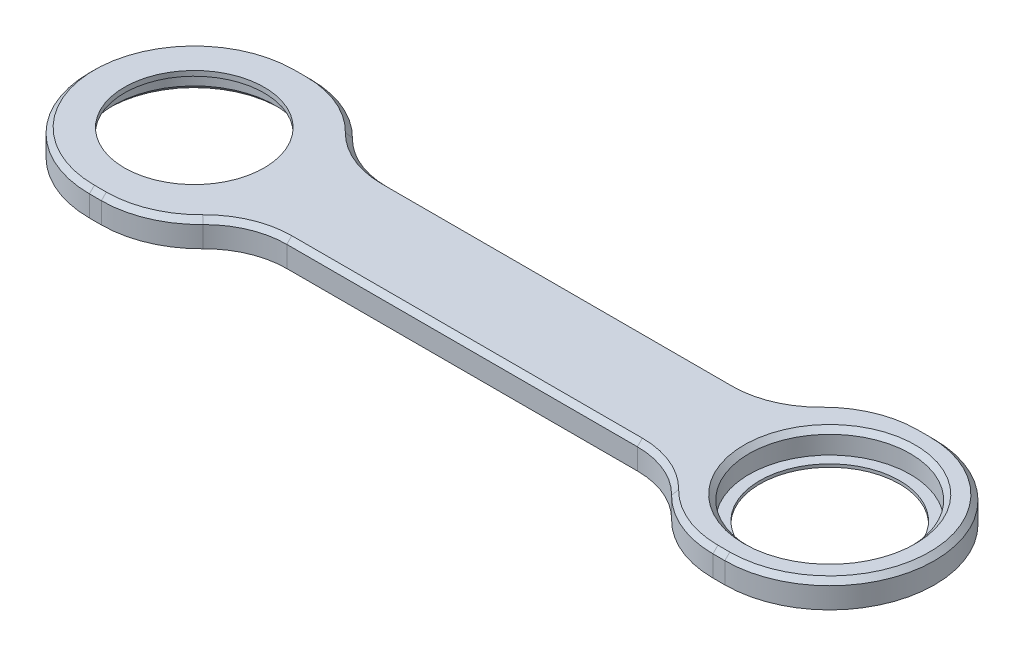
ISO-10303-21;
HEADER;
FILE_DESCRIPTION(('STEP AP214'),'2;1');
FILE_NAME('part.step','',(''),(''),'','','');
FILE_SCHEMA(('AUTOMOTIVE_DESIGN { 1 0 10303 214 1 1 1 1 }'));
ENDSEC;
DATA;
#1=APPLICATION_CONTEXT('core data for automotive mechanical design processes');
#2=APPLICATION_PROTOCOL_DEFINITION('international standard','automotive_design',2000,#1);
#3=PRODUCT_CONTEXT('',#1,'mechanical');
#4=PRODUCT('Part','Part','',(#3));
#5=PRODUCT_RELATED_PRODUCT_CATEGORY('part','',(#4));
#6=PRODUCT_DEFINITION_FORMATION('','',#4);
#7=PRODUCT_DEFINITION_CONTEXT('part definition',#1,'design');
#8=PRODUCT_DEFINITION('design','',#6,#7);
#9=PRODUCT_DEFINITION_SHAPE('','',#8);
#10=(LENGTH_UNIT() NAMED_UNIT(*) SI_UNIT(.MILLI.,.METRE.));
#11=(NAMED_UNIT(*) PLANE_ANGLE_UNIT() SI_UNIT($,.RADIAN.));
#12=(NAMED_UNIT(*) SI_UNIT($,.STERADIAN.) SOLID_ANGLE_UNIT());
#13=UNCERTAINTY_MEASURE_WITH_UNIT(LENGTH_MEASURE(1.E-05),#10,'distance_accuracy_value','');
#14=(GEOMETRIC_REPRESENTATION_CONTEXT(3) GLOBAL_UNCERTAINTY_ASSIGNED_CONTEXT((#13)) GLOBAL_UNIT_ASSIGNED_CONTEXT((#10,
#11,#12)) REPRESENTATION_CONTEXT('',''));
#15=CARTESIAN_POINT('',(0.,0.,0.));
#16=DIRECTION('',(0.,0.,1.));
#17=DIRECTION('',(1.,0.,0.));
#18=AXIS2_PLACEMENT_3D('',#15,#16,#17);
#19=CARTESIAN_POINT('',(-63.625,5.2,0.));
#20=DIRECTION('',(0.,-1.,0.));
#21=DIRECTION('',(0.,0.,-1.));
#22=AXIS2_PLACEMENT_3D('',#19,#20,#21);
#23=CYLINDRICAL_SURFACE('',#22,16.15);
#24=CARTESIAN_POINT('',(-63.625,0.99999999999997,0.));
#25=DIRECTION('',(0.,1.,0.));
#26=DIRECTION('',(0.,0.,1.));
#27=AXIS2_PLACEMENT_3D('',#24,#25,#26);
#28=CIRCLE('',#27,16.15);
#29=CARTESIAN_POINT('',(-63.625,0.99999999999997,16.15));
#30=VERTEX_POINT('',#29);
#31=EDGE_CURVE('E11',#30,#30,#28,.F.);
#32=ORIENTED_EDGE('',*,*,#31,.T.);
#33=EDGE_LOOP('',(#32));
#34=FACE_BOUND('',#33,.T.);
#35=CARTESIAN_POINT('',(-63.625,4.2,0.));
#36=DIRECTION('',(0.,1.,0.));
#37=DIRECTION('',(0.,0.,1.));
#38=AXIS2_PLACEMENT_3D('',#35,#36,#37);
#39=CIRCLE('',#38,16.15);
#40=CARTESIAN_POINT('',(-63.625,4.2,16.15));
#41=VERTEX_POINT('',#40);
#42=EDGE_CURVE('E495',#41,#41,#39,.T.);
#43=ORIENTED_EDGE('',*,*,#42,.T.);
#44=EDGE_LOOP('',(#43));
#45=FACE_BOUND('',#44,.T.);
#46=ADVANCED_FACE('F43',(#34,#45),#23,.F.);
#47=CARTESIAN_POINT('',(63.625,5.2,0.));
#48=DIRECTION('',(0.,-1.,0.));
#49=DIRECTION('',(0.,0.,-1.));
#50=AXIS2_PLACEMENT_3D('',#47,#48,#49);
#51=CYLINDRICAL_SURFACE('',#50,16.15);
#52=CARTESIAN_POINT('',(63.625,4.20000000000002,0.));
#53=DIRECTION('',(0.,1.,0.));
#54=DIRECTION('',(0.,0.,1.));
#55=AXIS2_PLACEMENT_3D('',#52,#53,#54);
#56=CIRCLE('',#55,16.15);
#57=CARTESIAN_POINT('',(63.625,4.20000000000002,16.15));
#58=VERTEX_POINT('',#57);
#59=EDGE_CURVE('E388',#58,#58,#56,.T.);
#60=ORIENTED_EDGE('',*,*,#59,.T.);
#61=EDGE_LOOP('',(#60));
#62=FACE_BOUND('',#61,.T.);
#63=CARTESIAN_POINT('',(63.625,0.6,0.));
#64=DIRECTION('',(0.,-1.,0.));
#65=DIRECTION('',(0.,0.,-1.));
#66=AXIS2_PLACEMENT_3D('',#63,#64,#65);
#67=CIRCLE('',#66,16.15);
#68=CARTESIAN_POINT('',(63.625,0.6,-16.15));
#69=VERTEX_POINT('',#68);
#70=EDGE_CURVE('E433',#69,#69,#67,.T.);
#71=ORIENTED_EDGE('',*,*,#70,.T.);
#72=EDGE_LOOP('',(#71));
#73=FACE_BOUND('',#72,.T.);
#74=ADVANCED_FACE('F516',(#62,#73),#51,.F.);
#75=CARTESIAN_POINT('',(35.1066134191231,5.2,26.5457507457693));
#76=DIRECTION('',(0.,-1.,0.));
#77=DIRECTION('',(0.,0.,-1.));
#78=AXIS2_PLACEMENT_3D('',#75,#76,#77);
#79=CYLINDRICAL_SURFACE('',#78,16.5457507457693);
#80=DIRECTION('',(0.,-1.,0.));
#81=VECTOR('',#80,1.);
#82=CARTESIAN_POINT('',(46.9387183735375,5.2,14.9801482932877));
#83=LINE('',#82,#81);
#84=CARTESIAN_POINT('',(46.9387183735375,0.,14.9801482932877));
#85=VERTEX_POINT('',#84);
#86=CARTESIAN_POINT('',(46.9387183735375,4.2,14.9801482932877));
#87=VERTEX_POINT('',#86);
#88=EDGE_CURVE('E302',#85,#87,#83,.F.);
#89=ORIENTED_EDGE('',*,*,#88,.T.);
#90=CARTESIAN_POINT('',(35.1066134191231,4.2,26.5457507457693));
#91=DIRECTION('',(0.,1.,0.));
#92=DIRECTION('',(0.,0.,1.));
#93=AXIS2_PLACEMENT_3D('',#90,#91,#92);
#94=CIRCLE('',#93,16.5457507457693);
#95=CARTESIAN_POINT('',(35.106613419123,4.2,9.99999999999998));
#96=VERTEX_POINT('',#95);
#97=EDGE_CURVE('E60',#87,#96,#94,.T.);
#98=ORIENTED_EDGE('',*,*,#97,.T.);
#99=DIRECTION('',(0.,-1.,0.));
#100=VECTOR('',#99,1.);
#101=CARTESIAN_POINT('',(35.106613419123,5.2,9.99999999999998));
#102=LINE('',#101,#100);
#103=CARTESIAN_POINT('',(35.106613419123,0.,9.99999999999998));
#104=VERTEX_POINT('',#103);
#105=EDGE_CURVE('E268',#96,#104,#102,.T.);
#106=ORIENTED_EDGE('',*,*,#105,.T.);
#107=CARTESIAN_POINT('',(35.1066134191231,0.,26.5457507457693));
#108=DIRECTION('',(0.,1.,0.));
#109=DIRECTION('',(0.,0.,1.));
#110=AXIS2_PLACEMENT_3D('',#107,#108,#109);
#111=CIRCLE('',#110,16.5457507457693);
#112=EDGE_CURVE('E235',#85,#104,#111,.T.);
#113=ORIENTED_EDGE('',*,*,#112,.F.);
#114=EDGE_LOOP('',(#89,#98,#106,#113));
#115=FACE_BOUND('',#114,.T.);
#116=ADVANCED_FACE('F522',(#115),#79,.F.);
#117=CARTESIAN_POINT('',(0.,5.2,21.));
#118=DIRECTION('',(0.,0.,1.));
#119=DIRECTION('',(1.,0.,0.));
#120=AXIS2_PLACEMENT_3D('',#117,#118,#119);
#121=PLANE('',#120);
#122=DIRECTION('',(0.,-1.,0.));
#123=VECTOR('',#122,1.);
#124=CARTESIAN_POINT('',(63.625,5.2,21.));
#125=LINE('',#124,#123);
#126=CARTESIAN_POINT('',(63.625,4.2,21.));
#127=VERTEX_POINT('',#126);
#128=CARTESIAN_POINT('',(63.625,0.,21.));
#129=VERTEX_POINT('',#128);
#130=EDGE_CURVE('E207',#127,#129,#125,.T.);
#131=ORIENTED_EDGE('',*,*,#130,.F.);
#132=DIRECTION('',(-1.,0.,0.));
#133=VECTOR('',#132,1.);
#134=CARTESIAN_POINT('',(0.,4.2,21.));
#135=LINE('',#134,#133);
#136=CARTESIAN_POINT('',(61.2410067812604,4.2,21.));
#137=VERTEX_POINT('',#136);
#138=EDGE_CURVE('E413',#127,#137,#135,.T.);
#139=ORIENTED_EDGE('',*,*,#138,.T.);
#140=DIRECTION('',(0.,-1.,0.));
#141=VECTOR('',#140,1.);
#142=CARTESIAN_POINT('',(61.2410067812604,5.2,21.));
#143=LINE('',#142,#141);
#144=CARTESIAN_POINT('',(61.2410067812604,0.,21.));
#145=VERTEX_POINT('',#144);
#146=EDGE_CURVE('E218',#137,#145,#143,.T.);
#147=ORIENTED_EDGE('',*,*,#146,.T.);
#148=DIRECTION('',(-1.,0.,0.));
#149=VECTOR('',#148,1.);
#150=CARTESIAN_POINT('',(0.,0.,21.));
#151=LINE('',#150,#149);
#152=EDGE_CURVE('E226',#129,#145,#151,.T.);
#153=ORIENTED_EDGE('',*,*,#152,.F.);
#154=EDGE_LOOP('',(#131,#139,#147,#153));
#155=FACE_BOUND('',#154,.T.);
#156=ADVANCED_FACE('F231',(#155),#121,.T.);
#157=CARTESIAN_POINT('',(63.625,5.2,0.));
#158=DIRECTION('',(0.,-1.,0.));
#159=DIRECTION('',(0.,0.,-1.));
#160=AXIS2_PLACEMENT_3D('',#157,#158,#159);
#161=CYLINDRICAL_SURFACE('',#160,21.);
#162=DIRECTION('',(0.,-1.,0.));
#163=VECTOR('',#162,1.);
#164=CARTESIAN_POINT('',(63.625,5.2,-21.));
#165=LINE('',#164,#163);
#166=CARTESIAN_POINT('',(63.625,4.2,-21.));
#167=VERTEX_POINT('',#166);
#168=CARTESIAN_POINT('',(63.625,0.,-21.));
#169=VERTEX_POINT('',#168);
#170=EDGE_CURVE('E219',#167,#169,#165,.T.);
#171=ORIENTED_EDGE('',*,*,#170,.F.);
#172=CARTESIAN_POINT('',(63.625,4.19999999999999,0.));
#173=DIRECTION('',(0.,1.,0.));
#174=DIRECTION('',(0.,0.,1.));
#175=AXIS2_PLACEMENT_3D('',#172,#173,#174);
#176=CIRCLE('',#175,21.);
#177=EDGE_CURVE('E213',#167,#127,#176,.F.);
#178=ORIENTED_EDGE('',*,*,#177,.T.);
#179=ORIENTED_EDGE('',*,*,#130,.T.);
#180=CARTESIAN_POINT('',(63.625,0.,0.));
#181=DIRECTION('',(0.,1.,0.));
#182=DIRECTION('',(0.,0.,1.));
#183=AXIS2_PLACEMENT_3D('',#180,#181,#182);
#184=CIRCLE('',#183,21.);
#185=EDGE_CURVE('E211',#129,#169,#184,.T.);
#186=ORIENTED_EDGE('',*,*,#185,.T.);
#187=EDGE_LOOP('',(#171,#178,#179,#186));
#188=FACE_BOUND('',#187,.T.);
#189=ADVANCED_FACE('F210',(#188),#161,.T.);
#190=CARTESIAN_POINT('',(0.,5.2,-21.));
#191=DIRECTION('',(0.,0.,1.));
#192=DIRECTION('',(1.,0.,0.));
#193=AXIS2_PLACEMENT_3D('',#190,#191,#192);
#194=PLANE('',#193);
#195=DIRECTION('',(0.,1.,0.));
#196=VECTOR('',#195,1.);
#197=CARTESIAN_POINT('',(61.2410067812603,5.2,-21.));
#198=LINE('',#197,#196);
#199=CARTESIAN_POINT('',(61.2410067812603,0.,-21.));
#200=VERTEX_POINT('',#199);
#201=CARTESIAN_POINT('',(61.2410067812603,4.2,-21.));
#202=VERTEX_POINT('',#201);
#203=EDGE_CURVE('E308',#200,#202,#198,.T.);
#204=ORIENTED_EDGE('',*,*,#203,.T.);
#205=DIRECTION('',(1.,0.,0.));
#206=VECTOR('',#205,1.);
#207=CARTESIAN_POINT('',(63.625,4.2,-21.));
#208=LINE('',#207,#206);
#209=EDGE_CURVE('E407',#202,#167,#208,.T.);
#210=ORIENTED_EDGE('',*,*,#209,.T.);
#211=ORIENTED_EDGE('',*,*,#170,.T.);
#212=DIRECTION('',(-1.,0.,0.));
#213=VECTOR('',#212,1.);
#214=CARTESIAN_POINT('',(0.,0.,-21.));
#215=LINE('',#214,#213);
#216=EDGE_CURVE('E228',#169,#200,#215,.T.);
#217=ORIENTED_EDGE('',*,*,#216,.T.);
#218=EDGE_LOOP('',(#204,#210,#211,#217));
#219=FACE_BOUND('',#218,.T.);
#220=ADVANCED_FACE('F549',(#219),#194,.F.);
#221=CARTESIAN_POINT('',(35.1066134191231,5.2,-26.5457507457693));
#222=DIRECTION('',(0.,-1.,0.));
#223=DIRECTION('',(0.,0.,-1.));
#224=AXIS2_PLACEMENT_3D('',#221,#222,#223);
#225=CYLINDRICAL_SURFACE('',#224,16.5457507457693);
#226=DIRECTION('',(0.,-1.,0.));
#227=VECTOR('',#226,1.);
#228=CARTESIAN_POINT('',(35.106613419123,5.2,-9.99999999999999));
#229=LINE('',#228,#227);
#230=CARTESIAN_POINT('',(35.106613419123,4.2,-9.99999999999999));
#231=VERTEX_POINT('',#230);
#232=CARTESIAN_POINT('',(35.106613419123,0.,-9.99999999999999));
#233=VERTEX_POINT('',#232);
#234=EDGE_CURVE('E283',#231,#233,#229,.T.);
#235=ORIENTED_EDGE('',*,*,#234,.F.);
#236=CARTESIAN_POINT('',(35.1066134191231,4.2,-26.5457507457693));
#237=DIRECTION('',(0.,1.,0.));
#238=DIRECTION('',(0.,0.,1.));
#239=AXIS2_PLACEMENT_3D('',#236,#237,#238);
#240=CIRCLE('',#239,16.5457507457693);
#241=CARTESIAN_POINT('',(46.9387183735375,4.2,-14.9801482932877));
#242=VERTEX_POINT('',#241);
#243=EDGE_CURVE('E395',#231,#242,#240,.T.);
#244=ORIENTED_EDGE('',*,*,#243,.T.);
#245=DIRECTION('',(0.,-1.,0.));
#246=VECTOR('',#245,1.);
#247=CARTESIAN_POINT('',(46.9387183735375,5.2,-14.9801482932877));
#248=LINE('',#247,#246);
#249=CARTESIAN_POINT('',(46.9387183735375,0.,-14.9801482932877));
#250=VERTEX_POINT('',#249);
#251=EDGE_CURVE('E305',#242,#250,#248,.T.);
#252=ORIENTED_EDGE('',*,*,#251,.T.);
#253=CARTESIAN_POINT('',(35.1066134191231,0.,-26.5457507457693));
#254=DIRECTION('',(0.,1.,0.));
#255=DIRECTION('',(0.,0.,1.));
#256=AXIS2_PLACEMENT_3D('',#253,#254,#255);
#257=CIRCLE('',#256,16.5457507457693);
#258=EDGE_CURVE('E1063',#233,#250,#257,.T.);
#259=ORIENTED_EDGE('',*,*,#258,.F.);
#260=EDGE_LOOP('',(#235,#244,#252,#259));
#261=FACE_BOUND('',#260,.T.);
#262=ADVANCED_FACE('F556',(#261),#225,.F.);
#263=CARTESIAN_POINT('',(0.,5.2,-9.99999999999999));
#264=DIRECTION('',(0.,0.,-1.));
#265=DIRECTION('',(-1.,0.,0.));
#266=AXIS2_PLACEMENT_3D('',#263,#264,#265);
#267=PLANE('',#266);
#268=DIRECTION('',(0.,-1.,0.));
#269=VECTOR('',#268,1.);
#270=CARTESIAN_POINT('',(-35.106613419123,5.2,-9.99999999999999));
#271=LINE('',#270,#269);
#272=CARTESIAN_POINT('',(-35.106613419123,4.2,-9.99999999999999));
#273=VERTEX_POINT('',#272);
#274=CARTESIAN_POINT('',(-35.106613419123,0.,-9.99999999999999));
#275=VERTEX_POINT('',#274);
#276=EDGE_CURVE('E280',#273,#275,#271,.T.);
#277=ORIENTED_EDGE('',*,*,#276,.F.);
#278=DIRECTION('',(1.,0.,0.));
#279=VECTOR('',#278,1.);
#280=CARTESIAN_POINT('',(0.,4.20000000000003,-9.99999999999999));
#281=LINE('',#280,#279);
#282=EDGE_CURVE('E385',#273,#231,#281,.T.);
#283=ORIENTED_EDGE('',*,*,#282,.T.);
#284=ORIENTED_EDGE('',*,*,#234,.T.);
#285=DIRECTION('',(1.,0.,0.));
#286=VECTOR('',#285,1.);
#287=CARTESIAN_POINT('',(0.,0.,-9.99999999999999));
#288=LINE('',#287,#286);
#289=EDGE_CURVE('E1066',#275,#233,#288,.T.);
#290=ORIENTED_EDGE('',*,*,#289,.F.);
#291=EDGE_LOOP('',(#277,#283,#284,#290));
#292=FACE_BOUND('',#291,.T.);
#293=ADVANCED_FACE('F552',(#292),#267,.T.);
#294=CARTESIAN_POINT('',(-35.1066134191231,5.2,-26.5457507457693));
#295=DIRECTION('',(0.,-1.,0.));
#296=DIRECTION('',(0.,0.,-1.));
#297=AXIS2_PLACEMENT_3D('',#294,#295,#296);
#298=CYLINDRICAL_SURFACE('',#297,16.5457507457693);
#299=DIRECTION('',(0.,-1.,0.));
#300=VECTOR('',#299,1.);
#301=CARTESIAN_POINT('',(-46.9387183735375,5.2,-14.9801482932877));
#302=LINE('',#301,#300);
#303=CARTESIAN_POINT('',(-46.9387183735375,0.,-14.9801482932877));
#304=VERTEX_POINT('',#303);
#305=CARTESIAN_POINT('',(-46.9387183735375,4.2,-14.9801482932877));
#306=VERTEX_POINT('',#305);
#307=EDGE_CURVE('E315',#304,#306,#302,.F.);
#308=ORIENTED_EDGE('',*,*,#307,.T.);
#309=CARTESIAN_POINT('',(-35.1066134191231,4.2,-26.5457507457693));
#310=DIRECTION('',(0.,1.,0.));
#311=DIRECTION('',(0.,0.,1.));
#312=AXIS2_PLACEMENT_3D('',#309,#310,#311);
#313=CIRCLE('',#312,16.5457507457693);
#314=EDGE_CURVE('E392',#306,#273,#313,.T.);
#315=ORIENTED_EDGE('',*,*,#314,.T.);
#316=ORIENTED_EDGE('',*,*,#276,.T.);
#317=CARTESIAN_POINT('',(-35.1066134191231,0.,-26.5457507457693));
#318=DIRECTION('',(0.,1.,0.));
#319=DIRECTION('',(0.,0.,1.));
#320=AXIS2_PLACEMENT_3D('',#317,#318,#319);
#321=CIRCLE('',#320,16.5457507457693);
#322=EDGE_CURVE('E260',#304,#275,#321,.T.);
#323=ORIENTED_EDGE('',*,*,#322,.F.);
#324=EDGE_LOOP('',(#308,#315,#316,#323));
#325=FACE_BOUND('',#324,.T.);
#326=ADVANCED_FACE('F547',(#325),#298,.F.);
#327=DIRECTION('',(0.,-1.,0.));
#328=VECTOR('',#327,1.);
#329=CARTESIAN_POINT('',(-63.625,5.2,-21.));
#330=LINE('',#329,#328);
#331=CARTESIAN_POINT('',(-63.625,4.2,-21.));
#332=VERTEX_POINT('',#331);
#333=CARTESIAN_POINT('',(-63.625,0.,-21.));
#334=VERTEX_POINT('',#333);
#335=EDGE_CURVE('E277',#332,#334,#330,.T.);
#336=ORIENTED_EDGE('',*,*,#335,.F.);
#337=DIRECTION('',(1.,0.,0.));
#338=VECTOR('',#337,1.);
#339=CARTESIAN_POINT('',(-61.2410067812603,4.2,-21.));
#340=LINE('',#339,#338);
#341=CARTESIAN_POINT('',(-61.2410067812603,4.2,-21.));
#342=VERTEX_POINT('',#341);
#343=EDGE_CURVE('E404',#332,#342,#340,.T.);
#344=ORIENTED_EDGE('',*,*,#343,.T.);
#345=DIRECTION('',(0.,1.,0.));
#346=VECTOR('',#345,1.);
#347=CARTESIAN_POINT('',(-61.2410067812603,0.,-21.));
#348=LINE('',#347,#346);
#349=CARTESIAN_POINT('',(-61.2410067812603,0.,-21.));
#350=VERTEX_POINT('',#349);
#351=EDGE_CURVE('E312',#342,#350,#348,.F.);
#352=ORIENTED_EDGE('',*,*,#351,.T.);
#353=EDGE_CURVE('E254',#350,#334,#215,.T.);
#354=ORIENTED_EDGE('',*,*,#353,.T.);
#355=EDGE_LOOP('',(#336,#344,#352,#354));
#356=FACE_BOUND('',#355,.T.);
#357=ADVANCED_FACE('F544',(#356),#194,.F.);
#358=CARTESIAN_POINT('',(-63.625,5.2,0.));
#359=DIRECTION('',(0.,-1.,0.));
#360=DIRECTION('',(0.,0.,-1.));
#361=AXIS2_PLACEMENT_3D('',#358,#359,#360);
#362=CYLINDRICAL_SURFACE('',#361,21.);
#363=DIRECTION('',(0.,-1.,0.));
#364=VECTOR('',#363,1.);
#365=CARTESIAN_POINT('',(-63.625,5.2,21.));
#366=LINE('',#365,#364);
#367=CARTESIAN_POINT('',(-63.625,4.2,21.));
#368=VERTEX_POINT('',#367);
#369=CARTESIAN_POINT('',(-63.625,0.,21.));
#370=VERTEX_POINT('',#369);
#371=EDGE_CURVE('E274',#368,#370,#366,.T.);
#372=ORIENTED_EDGE('',*,*,#371,.F.);
#373=CARTESIAN_POINT('',(-63.625,4.2,0.));
#374=DIRECTION('',(0.,1.,0.));
#375=DIRECTION('',(0.,0.,1.));
#376=AXIS2_PLACEMENT_3D('',#373,#374,#375);
#377=CIRCLE('',#376,21.);
#378=EDGE_CURVE('E410',#368,#332,#377,.F.);
#379=ORIENTED_EDGE('',*,*,#378,.T.);
#380=ORIENTED_EDGE('',*,*,#335,.T.);
#381=CARTESIAN_POINT('',(-63.625,0.,0.));
#382=DIRECTION('',(0.,1.,0.));
#383=DIRECTION('',(0.,0.,1.));
#384=AXIS2_PLACEMENT_3D('',#381,#382,#383);
#385=CIRCLE('',#384,21.);
#386=EDGE_CURVE('E245',#334,#370,#385,.T.);
#387=ORIENTED_EDGE('',*,*,#386,.T.);
#388=EDGE_LOOP('',(#372,#379,#380,#387));
#389=FACE_BOUND('',#388,.T.);
#390=ADVANCED_FACE('F540',(#389),#362,.T.);
#391=DIRECTION('',(0.,-1.,0.));
#392=VECTOR('',#391,1.);
#393=CARTESIAN_POINT('',(-61.2410067812604,5.2,21.));
#394=LINE('',#393,#392);
#395=CARTESIAN_POINT('',(-61.2410067812604,0.,21.));
#396=VERTEX_POINT('',#395);
#397=CARTESIAN_POINT('',(-61.2410067812604,4.2,21.));
#398=VERTEX_POINT('',#397);
#399=EDGE_CURVE('E322',#396,#398,#394,.F.);
#400=ORIENTED_EDGE('',*,*,#399,.T.);
#401=DIRECTION('',(-1.,0.,0.));
#402=VECTOR('',#401,1.);
#403=CARTESIAN_POINT('',(0.,4.20000000000001,21.));
#404=LINE('',#403,#402);
#405=EDGE_CURVE('E326',#398,#368,#404,.T.);
#406=ORIENTED_EDGE('',*,*,#405,.T.);
#407=ORIENTED_EDGE('',*,*,#371,.T.);
#408=EDGE_CURVE('E237',#396,#370,#151,.T.);
#409=ORIENTED_EDGE('',*,*,#408,.F.);
#410=EDGE_LOOP('',(#400,#406,#407,#409));
#411=FACE_BOUND('',#410,.T.);
#412=ADVANCED_FACE('F536',(#411),#121,.T.);
#413=CARTESIAN_POINT('',(-35.1066134191231,5.2,26.5457507457693));
#414=DIRECTION('',(0.,-1.,0.));
#415=DIRECTION('',(0.,0.,-1.));
#416=AXIS2_PLACEMENT_3D('',#413,#414,#415);
#417=CYLINDRICAL_SURFACE('',#416,16.5457507457693);
#418=DIRECTION('',(0.,-1.,0.));
#419=VECTOR('',#418,1.);
#420=CARTESIAN_POINT('',(-35.106613419123,5.2,9.99999999999998));
#421=LINE('',#420,#419);
#422=CARTESIAN_POINT('',(-35.106613419123,4.2,9.99999999999998));
#423=VERTEX_POINT('',#422);
#424=CARTESIAN_POINT('',(-35.106613419123,0.,9.99999999999998));
#425=VERTEX_POINT('',#424);
#426=EDGE_CURVE('E271',#423,#425,#421,.T.);
#427=ORIENTED_EDGE('',*,*,#426,.F.);
#428=CARTESIAN_POINT('',(-35.1066134191231,4.2,26.5457507457693));
#429=DIRECTION('',(0.,1.,0.));
#430=DIRECTION('',(0.,0.,1.));
#431=AXIS2_PLACEMENT_3D('',#428,#429,#430);
#432=CIRCLE('',#431,16.5457507457693);
#433=CARTESIAN_POINT('',(-46.9387183735375,4.2,14.9801482932877));
#434=VERTEX_POINT('',#433);
#435=EDGE_CURVE('E422',#423,#434,#432,.T.);
#436=ORIENTED_EDGE('',*,*,#435,.T.);
#437=DIRECTION('',(0.,-1.,0.));
#438=VECTOR('',#437,1.);
#439=CARTESIAN_POINT('',(-46.9387183735375,5.2,14.9801482932877));
#440=LINE('',#439,#438);
#441=CARTESIAN_POINT('',(-46.9387183735375,0.,14.9801482932877));
#442=VERTEX_POINT('',#441);
#443=EDGE_CURVE('E319',#434,#442,#440,.T.);
#444=ORIENTED_EDGE('',*,*,#443,.T.);
#445=CARTESIAN_POINT('',(-35.1066134191231,0.,26.5457507457693));
#446=DIRECTION('',(0.,1.,0.));
#447=DIRECTION('',(0.,0.,1.));
#448=AXIS2_PLACEMENT_3D('',#445,#446,#447);
#449=CIRCLE('',#448,16.5457507457693);
#450=EDGE_CURVE('E244',#425,#442,#449,.T.);
#451=ORIENTED_EDGE('',*,*,#450,.F.);
#452=EDGE_LOOP('',(#427,#436,#444,#451));
#453=FACE_BOUND('',#452,.T.);
#454=ADVANCED_FACE('F533',(#453),#417,.F.);
#455=CARTESIAN_POINT('',(0.,5.2,9.99999999999998));
#456=DIRECTION('',(0.,0.,-1.));
#457=DIRECTION('',(-1.,0.,0.));
#458=AXIS2_PLACEMENT_3D('',#455,#456,#457);
#459=PLANE('',#458);
#460=ORIENTED_EDGE('',*,*,#105,.F.);
#461=DIRECTION('',(-1.,0.,0.));
#462=VECTOR('',#461,1.);
#463=CARTESIAN_POINT('',(-35.106613419123,4.2,9.99999999999998));
#464=LINE('',#463,#462);
#465=EDGE_CURVE('E67',#96,#423,#464,.T.);
#466=ORIENTED_EDGE('',*,*,#465,.T.);
#467=ORIENTED_EDGE('',*,*,#426,.T.);
#468=DIRECTION('',(1.,0.,0.));
#469=VECTOR('',#468,1.);
#470=CARTESIAN_POINT('',(0.,0.,9.99999999999998));
#471=LINE('',#470,#469);
#472=EDGE_CURVE('E252',#425,#104,#471,.T.);
#473=ORIENTED_EDGE('',*,*,#472,.T.);
#474=EDGE_LOOP('',(#460,#466,#467,#473));
#475=FACE_BOUND('',#474,.T.);
#476=ADVANCED_FACE('F529',(#475),#459,.F.);
#477=CARTESIAN_POINT('',(0.,5.2,0.));
#478=DIRECTION('',(0.,1.,0.));
#479=DIRECTION('',(0.,0.,1.));
#480=AXIS2_PLACEMENT_3D('',#477,#478,#479);
#481=PLANE('',#480);
#482=CARTESIAN_POINT('',(63.625,5.2,0.));
#483=DIRECTION('',(0.,1.,0.));
#484=DIRECTION('',(0.,0.,1.));
#485=AXIS2_PLACEMENT_3D('',#482,#483,#484);
#486=CIRCLE('',#485,17.15);
#487=CARTESIAN_POINT('',(63.625,5.2,17.15));
#488=VERTEX_POINT('',#487);
#489=EDGE_CURVE('E379',#488,#488,#486,.F.);
#490=ORIENTED_EDGE('',*,*,#489,.T.);
#491=EDGE_LOOP('',(#490));
#492=FACE_BOUND('',#491,.T.);
#493=CARTESIAN_POINT('',(35.1066134191231,5.2,-26.5457507457693));
#494=DIRECTION('',(0.,1.,0.));
#495=DIRECTION('',(0.,0.,1.));
#496=AXIS2_PLACEMENT_3D('',#493,#494,#495);
#497=CIRCLE('',#496,17.5457507457693);
#498=CARTESIAN_POINT('',(47.6538327939236,5.2,-14.2811408786234));
#499=VERTEX_POINT('',#498);
#500=CARTESIAN_POINT('',(35.106613419123,5.2,-9.));
#501=VERTEX_POINT('',#500);
#502=EDGE_CURVE('E370',#499,#501,#497,.F.);
#503=ORIENTED_EDGE('',*,*,#502,.T.);
#504=DIRECTION('',(-1.,0.,0.));
#505=VECTOR('',#504,1.);
#506=CARTESIAN_POINT('',(0.,5.2,-9.));
#507=LINE('',#506,#505);
#508=CARTESIAN_POINT('',(-35.106613419123,5.2,-9.));
#509=VERTEX_POINT('',#508);
#510=EDGE_CURVE('E376',#501,#509,#507,.T.);
#511=ORIENTED_EDGE('',*,*,#510,.T.);
#512=CARTESIAN_POINT('',(-35.1066134191231,5.2,-26.5457507457693));
#513=DIRECTION('',(0.,1.,0.));
#514=DIRECTION('',(0.,0.,1.));
#515=AXIS2_PLACEMENT_3D('',#512,#513,#514);
#516=CIRCLE('',#515,17.5457507457693);
#517=CARTESIAN_POINT('',(-47.6538327939236,5.2,-14.2811408786234));
#518=VERTEX_POINT('',#517);
#519=EDGE_CURVE('E373',#509,#518,#516,.F.);
#520=ORIENTED_EDGE('',*,*,#519,.T.);
#521=CARTESIAN_POINT('',(-61.2410067812603,5.2,-0.999999999999994));
#522=DIRECTION('',(0.,1.,0.));
#523=DIRECTION('',(0.,0.,1.));
#524=AXIS2_PLACEMENT_3D('',#521,#522,#523);
#525=CIRCLE('',#524,19.);
#526=CARTESIAN_POINT('',(-61.2410067812603,5.2,-20.));
#527=VERTEX_POINT('',#526);
#528=EDGE_CURVE('E367',#518,#527,#525,.T.);
#529=ORIENTED_EDGE('',*,*,#528,.T.);
#530=DIRECTION('',(-1.,0.,0.));
#531=VECTOR('',#530,1.);
#532=CARTESIAN_POINT('',(-63.625,5.2,-20.));
#533=LINE('',#532,#531);
#534=CARTESIAN_POINT('',(-63.625,5.2,-20.));
#535=VERTEX_POINT('',#534);
#536=EDGE_CURVE('E361',#527,#535,#533,.T.);
#537=ORIENTED_EDGE('',*,*,#536,.T.);
#538=CARTESIAN_POINT('',(-63.625,5.2,0.));
#539=DIRECTION('',(0.,1.,0.));
#540=DIRECTION('',(0.,0.,1.));
#541=AXIS2_PLACEMENT_3D('',#538,#539,#540);
#542=CIRCLE('',#541,20.);
#543=CARTESIAN_POINT('',(-63.625,5.2,20.));
#544=VERTEX_POINT('',#543);
#545=EDGE_CURVE('E355',#535,#544,#542,.T.);
#546=ORIENTED_EDGE('',*,*,#545,.T.);
#547=DIRECTION('',(1.,0.,0.));
#548=VECTOR('',#547,1.);
#549=CARTESIAN_POINT('',(0.,5.2,20.));
#550=LINE('',#549,#548);
#551=CARTESIAN_POINT('',(-61.2410067812604,5.2,20.));
#552=VERTEX_POINT('',#551);
#553=EDGE_CURVE('E351',#544,#552,#550,.T.);
#554=ORIENTED_EDGE('',*,*,#553,.T.);
#555=CARTESIAN_POINT('',(-61.2410067812604,5.2,1.00000000000002));
#556=DIRECTION('',(0.,1.,0.));
#557=DIRECTION('',(0.,0.,1.));
#558=AXIS2_PLACEMENT_3D('',#555,#556,#557);
#559=CIRCLE('',#558,19.);
#560=CARTESIAN_POINT('',(-47.6538327939236,5.2,14.2811408786234));
#561=VERTEX_POINT('',#560);
#562=EDGE_CURVE('E342',#552,#561,#559,.T.);
#563=ORIENTED_EDGE('',*,*,#562,.T.);
#564=CARTESIAN_POINT('',(-35.1066134191231,5.2,26.5457507457693));
#565=DIRECTION('',(0.,1.,0.));
#566=DIRECTION('',(0.,0.,1.));
#567=AXIS2_PLACEMENT_3D('',#564,#565,#566);
#568=CIRCLE('',#567,17.5457507457693);
#569=CARTESIAN_POINT('',(-35.106613419123,5.2,8.99999999999999));
#570=VERTEX_POINT('',#569);
#571=EDGE_CURVE('E336',#561,#570,#568,.F.);
#572=ORIENTED_EDGE('',*,*,#571,.T.);
#573=DIRECTION('',(1.,0.,0.));
#574=VECTOR('',#573,1.);
#575=CARTESIAN_POINT('',(35.106613419123,5.2,8.99999999999999));
#576=LINE('',#575,#574);
#577=CARTESIAN_POINT('',(35.106613419123,5.2,8.99999999999999));
#578=VERTEX_POINT('',#577);
#579=EDGE_CURVE('E330',#570,#578,#576,.T.);
#580=ORIENTED_EDGE('',*,*,#579,.T.);
#581=CARTESIAN_POINT('',(35.1066134191231,5.2,26.5457507457693));
#582=DIRECTION('',(0.,1.,0.));
#583=DIRECTION('',(0.,0.,1.));
#584=AXIS2_PLACEMENT_3D('',#581,#582,#583);
#585=CIRCLE('',#584,17.5457507457693);
#586=CARTESIAN_POINT('',(47.6538327939236,5.2,14.2811408786234));
#587=VERTEX_POINT('',#586);
#588=EDGE_CURVE('E333',#578,#587,#585,.F.);
#589=ORIENTED_EDGE('',*,*,#588,.T.);
#590=CARTESIAN_POINT('',(61.2410067812604,5.2,1.00000000000002));
#591=DIRECTION('',(0.,1.,0.));
#592=DIRECTION('',(0.,0.,1.));
#593=AXIS2_PLACEMENT_3D('',#590,#591,#592);
#594=CIRCLE('',#593,19.);
#595=CARTESIAN_POINT('',(61.2410067812604,5.2,20.));
#596=VERTEX_POINT('',#595);
#597=EDGE_CURVE('E339',#587,#596,#594,.T.);
#598=ORIENTED_EDGE('',*,*,#597,.T.);
#599=DIRECTION('',(1.,0.,0.));
#600=VECTOR('',#599,1.);
#601=CARTESIAN_POINT('',(0.,5.2,20.));
#602=LINE('',#601,#600);
#603=CARTESIAN_POINT('',(63.625,5.2,20.));
#604=VERTEX_POINT('',#603);
#605=EDGE_CURVE('E345',#596,#604,#602,.T.);
#606=ORIENTED_EDGE('',*,*,#605,.T.);
#607=CARTESIAN_POINT('',(63.625,5.2,0.));
#608=DIRECTION('',(0.,1.,0.));
#609=DIRECTION('',(0.,0.,1.));
#610=AXIS2_PLACEMENT_3D('',#607,#608,#609);
#611=CIRCLE('',#610,20.);
#612=CARTESIAN_POINT('',(63.625,5.2,-20.));
#613=VERTEX_POINT('',#612);
#614=EDGE_CURVE('E348',#604,#613,#611,.T.);
#615=ORIENTED_EDGE('',*,*,#614,.T.);
#616=DIRECTION('',(-1.,0.,0.));
#617=VECTOR('',#616,1.);
#618=CARTESIAN_POINT('',(61.2410067812603,5.2,-20.));
#619=LINE('',#618,#617);
#620=CARTESIAN_POINT('',(61.2410067812603,5.2,-20.));
#621=VERTEX_POINT('',#620);
#622=EDGE_CURVE('E358',#613,#621,#619,.T.);
#623=ORIENTED_EDGE('',*,*,#622,.T.);
#624=CARTESIAN_POINT('',(61.2410067812603,5.2,-0.999999999999994));
#625=DIRECTION('',(0.,1.,0.));
#626=DIRECTION('',(0.,0.,1.));
#627=AXIS2_PLACEMENT_3D('',#624,#625,#626);
#628=CIRCLE('',#627,19.);
#629=EDGE_CURVE('E364',#621,#499,#628,.T.);
#630=ORIENTED_EDGE('',*,*,#629,.T.);
#631=EDGE_LOOP('',(#503,#511,#520,#529,#537,#546,#554,#563,#572,#580,#589,#598,#606,#615,#623,#630));
#632=FACE_BOUND('',#631,.T.);
#633=CARTESIAN_POINT('',(-63.625,5.2,0.));
#634=DIRECTION('',(0.,1.,0.));
#635=DIRECTION('',(0.,0.,1.));
#636=AXIS2_PLACEMENT_3D('',#633,#634,#635);
#637=CIRCLE('',#636,14.);
#638=CARTESIAN_POINT('',(-63.625,5.2,14.));
#639=VERTEX_POINT('',#638);
#640=EDGE_CURVE('E719',#639,#639,#637,.T.);
#641=ORIENTED_EDGE('',*,*,#640,.F.);
#642=EDGE_LOOP('',(#641));
#643=FACE_BOUND('',#642,.T.);
#644=ADVANCED_FACE('F532',(#492,#632,#643),#481,.T.);
#645=CARTESIAN_POINT('',(0.,0.,0.));
#646=DIRECTION('',(0.,1.,0.));
#647=DIRECTION('',(0.,0.,1.));
#648=AXIS2_PLACEMENT_3D('',#645,#646,#647);
#649=PLANE('',#648);
#650=CARTESIAN_POINT('',(-63.625,0.,0.));
#651=DIRECTION('',(0.,1.,0.));
#652=DIRECTION('',(0.,0.,1.));
#653=AXIS2_PLACEMENT_3D('',#650,#651,#652);
#654=CIRCLE('',#653,17.15);
#655=CARTESIAN_POINT('',(-63.625,0.,17.15));
#656=VERTEX_POINT('',#655);
#657=EDGE_CURVE('E53',#656,#656,#654,.T.);
#658=ORIENTED_EDGE('',*,*,#657,.T.);
#659=EDGE_LOOP('',(#658));
#660=FACE_BOUND('',#659,.T.);
#661=ORIENTED_EDGE('',*,*,#152,.T.);
#662=CARTESIAN_POINT('',(61.2410067812604,0.,1.00000000000002));
#663=DIRECTION('',(0.,1.,0.));
#664=DIRECTION('',(0.,0.,1.));
#665=AXIS2_PLACEMENT_3D('',#662,#663,#664);
#666=CIRCLE('',#665,20.);
#667=EDGE_CURVE('E299',#145,#85,#666,.F.);
#668=ORIENTED_EDGE('',*,*,#667,.T.);
#669=ORIENTED_EDGE('',*,*,#112,.T.);
#670=ORIENTED_EDGE('',*,*,#472,.F.);
#671=ORIENTED_EDGE('',*,*,#450,.T.);
#672=CARTESIAN_POINT('',(-61.2410067812604,0.,1.00000000000002));
#673=DIRECTION('',(0.,1.,0.));
#674=DIRECTION('',(0.,0.,1.));
#675=AXIS2_PLACEMENT_3D('',#672,#673,#674);
#676=CIRCLE('',#675,20.);
#677=EDGE_CURVE('E290',#442,#396,#676,.F.);
#678=ORIENTED_EDGE('',*,*,#677,.T.);
#679=ORIENTED_EDGE('',*,*,#408,.T.);
#680=ORIENTED_EDGE('',*,*,#386,.F.);
#681=ORIENTED_EDGE('',*,*,#353,.F.);
#682=CARTESIAN_POINT('',(-61.2410067812603,0.,-0.999999999999994));
#683=DIRECTION('',(0.,1.,0.));
#684=DIRECTION('',(0.,0.,1.));
#685=AXIS2_PLACEMENT_3D('',#682,#683,#684);
#686=CIRCLE('',#685,20.);
#687=EDGE_CURVE('E293',#350,#304,#686,.F.);
#688=ORIENTED_EDGE('',*,*,#687,.T.);
#689=ORIENTED_EDGE('',*,*,#322,.T.);
#690=ORIENTED_EDGE('',*,*,#289,.T.);
#691=ORIENTED_EDGE('',*,*,#258,.T.);
#692=CARTESIAN_POINT('',(61.2410067812603,0.,-0.999999999999994));
#693=DIRECTION('',(0.,1.,0.));
#694=DIRECTION('',(0.,0.,1.));
#695=AXIS2_PLACEMENT_3D('',#692,#693,#694);
#696=CIRCLE('',#695,20.);
#697=EDGE_CURVE('E296',#250,#200,#696,.F.);
#698=ORIENTED_EDGE('',*,*,#697,.T.);
#699=ORIENTED_EDGE('',*,*,#216,.F.);
#700=ORIENTED_EDGE('',*,*,#185,.F.);
#701=EDGE_LOOP('',(#661,#668,#669,#670,#671,#678,#679,#680,#681,#688,#689,#690,#691,#698,#699,#700));
#702=FACE_BOUND('',#701,.T.);
#703=CARTESIAN_POINT('',(63.625,0.,0.));
#704=DIRECTION('',(0.,-1.,0.));
#705=DIRECTION('',(0.,0.,-1.));
#706=AXIS2_PLACEMENT_3D('',#703,#704,#705);
#707=CIRCLE('',#706,14.);
#708=CARTESIAN_POINT('',(63.625,0.,-14.));
#709=VERTEX_POINT('',#708);
#710=EDGE_CURVE('E498',#709,#709,#707,.T.);
#711=ORIENTED_EDGE('',*,*,#710,.F.);
#712=EDGE_LOOP('',(#711));
#713=FACE_BOUND('',#712,.T.);
#714=ADVANCED_FACE('F224',(#660,#702,#713),#649,.F.);
#715=CARTESIAN_POINT('',(61.2410067812604,5.2,1.00000000000002));
#716=DIRECTION('',(0.,-1.,0.));
#717=DIRECTION('',(0.,0.,-1.));
#718=AXIS2_PLACEMENT_3D('',#715,#716,#717);
#719=CYLINDRICAL_SURFACE('',#718,20.);
#720=ORIENTED_EDGE('',*,*,#146,.F.);
#721=CARTESIAN_POINT('',(61.2410067812604,4.2,1.00000000000002));
#722=DIRECTION('',(0.,1.,0.));
#723=DIRECTION('',(0.,0.,1.));
#724=AXIS2_PLACEMENT_3D('',#721,#722,#723);
#725=CIRCLE('',#724,20.);
#726=EDGE_CURVE('E419',#137,#87,#725,.F.);
#727=ORIENTED_EDGE('',*,*,#726,.T.);
#728=ORIENTED_EDGE('',*,*,#88,.F.);
#729=ORIENTED_EDGE('',*,*,#667,.F.);
#730=EDGE_LOOP('',(#720,#727,#728,#729));
#731=FACE_BOUND('',#730,.T.);
#732=ADVANCED_FACE('F565',(#731),#719,.T.);
#733=CARTESIAN_POINT('',(61.2410067812603,5.2,-0.999999999999994));
#734=DIRECTION('',(0.,-1.,0.));
#735=DIRECTION('',(0.,0.,-1.));
#736=AXIS2_PLACEMENT_3D('',#733,#734,#735);
#737=CYLINDRICAL_SURFACE('',#736,20.);
#738=ORIENTED_EDGE('',*,*,#251,.F.);
#739=CARTESIAN_POINT('',(61.2410067812603,4.2,-0.999999999999994));
#740=DIRECTION('',(0.,1.,0.));
#741=DIRECTION('',(0.,0.,1.));
#742=AXIS2_PLACEMENT_3D('',#739,#740,#741);
#743=CIRCLE('',#742,20.);
#744=EDGE_CURVE('E401',#242,#202,#743,.F.);
#745=ORIENTED_EDGE('',*,*,#744,.T.);
#746=ORIENTED_EDGE('',*,*,#203,.F.);
#747=ORIENTED_EDGE('',*,*,#697,.F.);
#748=EDGE_LOOP('',(#738,#745,#746,#747));
#749=FACE_BOUND('',#748,.T.);
#750=ADVANCED_FACE('F568',(#749),#737,.T.);
#751=CARTESIAN_POINT('',(-61.2410067812603,5.2,-0.999999999999994));
#752=DIRECTION('',(0.,-1.,0.));
#753=DIRECTION('',(0.,0.,-1.));
#754=AXIS2_PLACEMENT_3D('',#751,#752,#753);
#755=CYLINDRICAL_SURFACE('',#754,20.);
#756=ORIENTED_EDGE('',*,*,#351,.F.);
#757=CARTESIAN_POINT('',(-61.2410067812603,4.2,-0.999999999999994));
#758=DIRECTION('',(0.,1.,0.));
#759=DIRECTION('',(0.,0.,1.));
#760=AXIS2_PLACEMENT_3D('',#757,#758,#759);
#761=CIRCLE('',#760,20.);
#762=EDGE_CURVE('E398',#342,#306,#761,.F.);
#763=ORIENTED_EDGE('',*,*,#762,.T.);
#764=ORIENTED_EDGE('',*,*,#307,.F.);
#765=ORIENTED_EDGE('',*,*,#687,.F.);
#766=EDGE_LOOP('',(#756,#763,#764,#765));
#767=FACE_BOUND('',#766,.T.);
#768=ADVANCED_FACE('F572',(#767),#755,.T.);
#769=CARTESIAN_POINT('',(-61.2410067812604,5.2,1.00000000000002));
#770=DIRECTION('',(0.,-1.,0.));
#771=DIRECTION('',(0.,0.,-1.));
#772=AXIS2_PLACEMENT_3D('',#769,#770,#771);
#773=CYLINDRICAL_SURFACE('',#772,20.);
#774=ORIENTED_EDGE('',*,*,#443,.F.);
#775=CARTESIAN_POINT('',(-61.2410067812604,4.2,1.00000000000002));
#776=DIRECTION('',(0.,1.,0.));
#777=DIRECTION('',(0.,0.,1.));
#778=AXIS2_PLACEMENT_3D('',#775,#776,#777);
#779=CIRCLE('',#778,20.);
#780=EDGE_CURVE('E416',#434,#398,#779,.F.);
#781=ORIENTED_EDGE('',*,*,#780,.T.);
#782=ORIENTED_EDGE('',*,*,#399,.F.);
#783=ORIENTED_EDGE('',*,*,#677,.F.);
#784=EDGE_LOOP('',(#774,#781,#782,#783));
#785=FACE_BOUND('',#784,.T.);
#786=ADVANCED_FACE('F576',(#785),#773,.T.);
#787=CARTESIAN_POINT('',(0.,5.2,-20.));
#788=DIRECTION('',(0.,0.707106781186543,-0.707106781186552));
#789=DIRECTION('',(1.,0.,0.));
#790=AXIS2_PLACEMENT_3D('',#787,#788,#789);
#791=PLANE('',#790);
#792=DIRECTION('',(0.,-0.707106781186552,-0.707106781186543));
#793=VECTOR('',#792,1.);
#794=CARTESIAN_POINT('',(61.2410067812603,5.2,-20.));
#795=LINE('',#794,#793);
#796=EDGE_CURVE('E484',#621,#202,#795,.T.);
#797=ORIENTED_EDGE('',*,*,#796,.F.);
#798=ORIENTED_EDGE('',*,*,#622,.F.);
#799=DIRECTION('',(0.,0.707106781186552,0.707106781186543));
#800=VECTOR('',#799,1.);
#801=CARTESIAN_POINT('',(63.625,4.2,-21.));
#802=LINE('',#801,#800);
#803=EDGE_CURVE('E240',#167,#613,#802,.T.);
#804=ORIENTED_EDGE('',*,*,#803,.F.);
#805=ORIENTED_EDGE('',*,*,#209,.F.);
#806=EDGE_LOOP('',(#797,#798,#804,#805));
#807=FACE_BOUND('',#806,.T.);
#808=ADVANCED_FACE('F580',(#807),#791,.T.);
#809=CARTESIAN_POINT('',(63.625,5.2,0.));
#810=DIRECTION('',(0.,-1.,0.));
#811=DIRECTION('',(0.,0.,-1.));
#812=AXIS2_PLACEMENT_3D('',#809,#810,#811);
#813=CONICAL_SURFACE('',#812,20.,0.78539816339745);
#814=ORIENTED_EDGE('',*,*,#803,.T.);
#815=ORIENTED_EDGE('',*,*,#614,.F.);
#816=DIRECTION('',(0.,0.707106781186546,-0.707106781186549));
#817=VECTOR('',#816,1.);
#818=CARTESIAN_POINT('',(63.625,4.19999999999999,21.));
#819=LINE('',#818,#817);
#820=EDGE_CURVE('E480',#127,#604,#819,.T.);
#821=ORIENTED_EDGE('',*,*,#820,.F.);
#822=ORIENTED_EDGE('',*,*,#177,.F.);
#823=EDGE_LOOP('',(#814,#815,#821,#822));
#824=FACE_BOUND('',#823,.T.);
#825=ADVANCED_FACE('F682',(#824),#813,.T.);
#826=CARTESIAN_POINT('',(61.2410067812603,5.2,-0.999999999999994));
#827=DIRECTION('',(0.,-1.,0.));
#828=DIRECTION('',(0.,0.,-1.));
#829=AXIS2_PLACEMENT_3D('',#826,#827,#828);
#830=CONICAL_SURFACE('',#829,19.,0.785398163397441);
#831=ORIENTED_EDGE('',*,*,#796,.T.);
#832=ORIENTED_EDGE('',*,*,#744,.F.);
#833=DIRECTION('',(-0.505662255979325,-0.707106781186554,-0.494272883008861));
#834=VECTOR('',#833,1.);
#835=CARTESIAN_POINT('',(47.6538327939236,5.2,-14.2811408786234));
#836=LINE('',#835,#834);
#837=EDGE_CURVE('E476',#499,#242,#836,.T.);
#838=ORIENTED_EDGE('',*,*,#837,.F.);
#839=ORIENTED_EDGE('',*,*,#629,.F.);
#840=EDGE_LOOP('',(#831,#832,#838,#839));
#841=FACE_BOUND('',#840,.T.);
#842=ADVANCED_FACE('F675',(#841),#830,.T.);
#843=CARTESIAN_POINT('',(0.,4.2,21.));
#844=DIRECTION('',(0.,-0.707106781186543,-0.707106781186552));
#845=DIRECTION('',(-1.,0.,0.));
#846=AXIS2_PLACEMENT_3D('',#843,#844,#845);
#847=PLANE('',#846);
#848=ORIENTED_EDGE('',*,*,#820,.T.);
#849=ORIENTED_EDGE('',*,*,#605,.F.);
#850=DIRECTION('',(0.,0.707106781186552,-0.707106781186543));
#851=VECTOR('',#850,1.);
#852=CARTESIAN_POINT('',(61.2410067812604,4.2,21.));
#853=LINE('',#852,#851);
#854=EDGE_CURVE('E472',#137,#596,#853,.T.);
#855=ORIENTED_EDGE('',*,*,#854,.F.);
#856=ORIENTED_EDGE('',*,*,#138,.F.);
#857=EDGE_LOOP('',(#848,#849,#855,#856));
#858=FACE_BOUND('',#857,.T.);
#859=ADVANCED_FACE('F668',(#858),#847,.F.);
#860=CARTESIAN_POINT('',(35.1066134191231,4.2,-26.5457507457693));
#861=DIRECTION('',(0.,1.,0.));
#862=DIRECTION('',(0.,0.,1.));
#863=AXIS2_PLACEMENT_3D('',#860,#861,#862);
#864=CONICAL_SURFACE('',#863,16.5457507457693,0.785398163397441);
#865=ORIENTED_EDGE('',*,*,#837,.T.);
#866=ORIENTED_EDGE('',*,*,#243,.F.);
#867=DIRECTION('',(0.,-0.707106781186552,-0.707106781186543));
#868=VECTOR('',#867,1.);
#869=CARTESIAN_POINT('',(35.106613419123,5.2,-9.));
#870=LINE('',#869,#868);
#871=EDGE_CURVE('E468',#501,#231,#870,.T.);
#872=ORIENTED_EDGE('',*,*,#871,.F.);
#873=ORIENTED_EDGE('',*,*,#502,.F.);
#874=EDGE_LOOP('',(#865,#866,#872,#873));
#875=FACE_BOUND('',#874,.T.);
#876=ADVANCED_FACE('F661',(#875),#864,.F.);
#877=CARTESIAN_POINT('',(61.2410067812604,5.2,1.00000000000002));
#878=DIRECTION('',(0.,-1.,0.));
#879=DIRECTION('',(0.,0.,-1.));
#880=AXIS2_PLACEMENT_3D('',#877,#878,#879);
#881=CONICAL_SURFACE('',#880,19.,0.785398163397441);
#882=ORIENTED_EDGE('',*,*,#854,.T.);
#883=ORIENTED_EDGE('',*,*,#597,.F.);
#884=DIRECTION('',(0.505662255979325,0.707106781186553,-0.494272883008862));
#885=VECTOR('',#884,1.);
#886=CARTESIAN_POINT('',(46.9387183735375,4.2,14.9801482932877));
#887=LINE('',#886,#885);
#888=EDGE_CURVE('E464',#87,#587,#887,.T.);
#889=ORIENTED_EDGE('',*,*,#888,.F.);
#890=ORIENTED_EDGE('',*,*,#726,.F.);
#891=EDGE_LOOP('',(#882,#883,#889,#890));
#892=FACE_BOUND('',#891,.T.);
#893=ADVANCED_FACE('F654',(#892),#881,.T.);
#894=CARTESIAN_POINT('',(0.,4.20000000000003,-9.99999999999999));
#895=DIRECTION('',(0.,-0.707106781186552,0.707106781186543));
#896=DIRECTION('',(1.,0.,0.));
#897=AXIS2_PLACEMENT_3D('',#894,#895,#896);
#898=PLANE('',#897);
#899=ORIENTED_EDGE('',*,*,#871,.T.);
#900=ORIENTED_EDGE('',*,*,#282,.F.);
#901=DIRECTION('',(0.,-0.707106781186543,-0.707106781186552));
#902=VECTOR('',#901,1.);
#903=CARTESIAN_POINT('',(-35.106613419123,5.2,-9.));
#904=LINE('',#903,#902);
#905=EDGE_CURVE('E460',#509,#273,#904,.T.);
#906=ORIENTED_EDGE('',*,*,#905,.F.);
#907=ORIENTED_EDGE('',*,*,#510,.F.);
#908=EDGE_LOOP('',(#899,#900,#906,#907));
#909=FACE_BOUND('',#908,.T.);
#910=ADVANCED_FACE('F647',(#909),#898,.F.);
#911=CARTESIAN_POINT('',(35.1066134191231,4.2,26.5457507457693));
#912=DIRECTION('',(0.,1.,0.));
#913=DIRECTION('',(0.,0.,1.));
#914=AXIS2_PLACEMENT_3D('',#911,#912,#913);
#915=CONICAL_SURFACE('',#914,16.5457507457693,0.785398163397441);
#916=ORIENTED_EDGE('',*,*,#888,.T.);
#917=ORIENTED_EDGE('',*,*,#588,.F.);
#918=DIRECTION('',(0.,0.707106781186551,-0.707106781186544));
#919=VECTOR('',#918,1.);
#920=CARTESIAN_POINT('',(35.106613419123,4.2,9.99999999999998));
#921=LINE('',#920,#919);
#922=EDGE_CURVE('E456',#96,#578,#921,.T.);
#923=ORIENTED_EDGE('',*,*,#922,.F.);
#924=ORIENTED_EDGE('',*,*,#97,.F.);
#925=EDGE_LOOP('',(#916,#917,#923,#924));
#926=FACE_BOUND('',#925,.T.);
#927=ADVANCED_FACE('F640',(#926),#915,.F.);
#928=CARTESIAN_POINT('',(-35.1066134191231,4.2,-26.5457507457693));
#929=DIRECTION('',(0.,1.,0.));
#930=DIRECTION('',(0.,0.,1.));
#931=AXIS2_PLACEMENT_3D('',#928,#929,#930);
#932=CONICAL_SURFACE('',#931,16.5457507457693,0.785398163397441);
#933=ORIENTED_EDGE('',*,*,#905,.T.);
#934=ORIENTED_EDGE('',*,*,#314,.F.);
#935=DIRECTION('',(0.505662255979325,-0.707106781186553,-0.494272883008862));
#936=VECTOR('',#935,1.);
#937=CARTESIAN_POINT('',(-47.6538327939236,5.2,-14.2811408786234));
#938=LINE('',#937,#936);
#939=EDGE_CURVE('E452',#518,#306,#938,.T.);
#940=ORIENTED_EDGE('',*,*,#939,.F.);
#941=ORIENTED_EDGE('',*,*,#519,.F.);
#942=EDGE_LOOP('',(#933,#934,#940,#941));
#943=FACE_BOUND('',#942,.T.);
#944=ADVANCED_FACE('F633',(#943),#932,.F.);
#945=CARTESIAN_POINT('',(0.,5.2,8.99999999999999));
#946=DIRECTION('',(0.,0.707106781186543,0.707106781186552));
#947=DIRECTION('',(-1.,0.,0.));
#948=AXIS2_PLACEMENT_3D('',#945,#946,#947);
#949=PLANE('',#948);
#950=ORIENTED_EDGE('',*,*,#922,.T.);
#951=ORIENTED_EDGE('',*,*,#579,.F.);
#952=DIRECTION('',(0.,0.707106781186552,-0.707106781186543));
#953=VECTOR('',#952,1.);
#954=CARTESIAN_POINT('',(-35.106613419123,4.2,9.99999999999998));
#955=LINE('',#954,#953);
#956=EDGE_CURVE('E448',#423,#570,#955,.T.);
#957=ORIENTED_EDGE('',*,*,#956,.F.);
#958=ORIENTED_EDGE('',*,*,#465,.F.);
#959=EDGE_LOOP('',(#950,#951,#957,#958));
#960=FACE_BOUND('',#959,.T.);
#961=ADVANCED_FACE('F626',(#960),#949,.T.);
#962=CARTESIAN_POINT('',(-61.2410067812603,5.2,-0.999999999999994));
#963=DIRECTION('',(0.,-1.,0.));
#964=DIRECTION('',(0.,0.,-1.));
#965=AXIS2_PLACEMENT_3D('',#962,#963,#964);
#966=CONICAL_SURFACE('',#965,19.,0.78539816339744);
#967=ORIENTED_EDGE('',*,*,#939,.T.);
#968=ORIENTED_EDGE('',*,*,#762,.F.);
#969=DIRECTION('',(0.,-0.707106781186554,-0.707106781186541));
#970=VECTOR('',#969,1.);
#971=CARTESIAN_POINT('',(-61.2410067812603,5.2,-20.));
#972=LINE('',#971,#970);
#973=EDGE_CURVE('E444',#527,#342,#972,.T.);
#974=ORIENTED_EDGE('',*,*,#973,.F.);
#975=ORIENTED_EDGE('',*,*,#528,.F.);
#976=EDGE_LOOP('',(#967,#968,#974,#975));
#977=FACE_BOUND('',#976,.T.);
#978=ADVANCED_FACE('F619',(#977),#966,.T.);
#979=CARTESIAN_POINT('',(-35.1066134191231,4.2,26.5457507457693));
#980=DIRECTION('',(0.,1.,0.));
#981=DIRECTION('',(0.,0.,1.));
#982=AXIS2_PLACEMENT_3D('',#979,#980,#981);
#983=CONICAL_SURFACE('',#982,16.5457507457693,0.785398163397441);
#984=ORIENTED_EDGE('',*,*,#956,.T.);
#985=ORIENTED_EDGE('',*,*,#571,.F.);
#986=DIRECTION('',(-0.505662255979325,0.707106781186553,-0.494272883008862));
#987=VECTOR('',#986,1.);
#988=CARTESIAN_POINT('',(-46.9387183735375,4.2,14.9801482932877));
#989=LINE('',#988,#987);
#990=EDGE_CURVE('E440',#434,#561,#989,.T.);
#991=ORIENTED_EDGE('',*,*,#990,.F.);
#992=ORIENTED_EDGE('',*,*,#435,.F.);
#993=EDGE_LOOP('',(#984,#985,#991,#992));
#994=FACE_BOUND('',#993,.T.);
#995=ADVANCED_FACE('F612',(#994),#983,.F.);
#996=CARTESIAN_POINT('',(0.,5.2,-20.));
#997=DIRECTION('',(0.,0.707106781186543,-0.707106781186552));
#998=DIRECTION('',(1.,0.,0.));
#999=AXIS2_PLACEMENT_3D('',#996,#997,#998);
#1000=PLANE('',#999);
#1001=ORIENTED_EDGE('',*,*,#973,.T.);
#1002=ORIENTED_EDGE('',*,*,#343,.F.);
#1003=DIRECTION('',(0.,-0.707106781186552,-0.707106781186543));
#1004=VECTOR('',#1003,1.);
#1005=CARTESIAN_POINT('',(-63.625,5.2,-20.));
#1006=LINE('',#1005,#1004);
#1007=EDGE_CURVE('E436',#535,#332,#1006,.T.);
#1008=ORIENTED_EDGE('',*,*,#1007,.F.);
#1009=ORIENTED_EDGE('',*,*,#536,.F.);
#1010=EDGE_LOOP('',(#1001,#1002,#1008,#1009));
#1011=FACE_BOUND('',#1010,.T.);
#1012=ADVANCED_FACE('F605',(#1011),#1000,.T.);
#1013=CARTESIAN_POINT('',(-61.2410067812604,5.2,1.00000000000002));
#1014=DIRECTION('',(0.,-1.,0.));
#1015=DIRECTION('',(0.,0.,-1.));
#1016=AXIS2_PLACEMENT_3D('',#1013,#1014,#1015);
#1017=CONICAL_SURFACE('',#1016,19.,0.785398163397441);
#1018=ORIENTED_EDGE('',*,*,#990,.T.);
#1019=ORIENTED_EDGE('',*,*,#562,.F.);
#1020=DIRECTION('',(0.,0.707106781186552,-0.707106781186543));
#1021=VECTOR('',#1020,1.);
#1022=CARTESIAN_POINT('',(-61.2410067812604,4.2,21.));
#1023=LINE('',#1022,#1021);
#1024=EDGE_CURVE('E432',#398,#552,#1023,.T.);
#1025=ORIENTED_EDGE('',*,*,#1024,.F.);
#1026=ORIENTED_EDGE('',*,*,#780,.F.);
#1027=EDGE_LOOP('',(#1018,#1019,#1025,#1026));
#1028=FACE_BOUND('',#1027,.T.);
#1029=ADVANCED_FACE('F598',(#1028),#1017,.T.);
#1030=CARTESIAN_POINT('',(-63.625,5.2,0.));
#1031=DIRECTION('',(0.,-1.,0.));
#1032=DIRECTION('',(0.,0.,-1.));
#1033=AXIS2_PLACEMENT_3D('',#1030,#1031,#1032);
#1034=CONICAL_SURFACE('',#1033,20.,0.785398163397441);
#1035=ORIENTED_EDGE('',*,*,#1007,.T.);
#1036=ORIENTED_EDGE('',*,*,#378,.F.);
#1037=DIRECTION('',(0.,-0.707106781186552,0.707106781186543));
#1038=VECTOR('',#1037,1.);
#1039=CARTESIAN_POINT('',(-63.625,5.2,20.));
#1040=LINE('',#1039,#1038);
#1041=EDGE_CURVE('E429',#544,#368,#1040,.T.);
#1042=ORIENTED_EDGE('',*,*,#1041,.F.);
#1043=ORIENTED_EDGE('',*,*,#545,.F.);
#1044=EDGE_LOOP('',(#1035,#1036,#1042,#1043));
#1045=FACE_BOUND('',#1044,.T.);
#1046=ADVANCED_FACE('F591',(#1045),#1034,.T.);
#1047=CARTESIAN_POINT('',(0.,4.20000000000001,21.));
#1048=DIRECTION('',(0.,-0.707106781186552,-0.707106781186543));
#1049=DIRECTION('',(-1.,0.,0.));
#1050=AXIS2_PLACEMENT_3D('',#1047,#1048,#1049);
#1051=PLANE('',#1050);
#1052=ORIENTED_EDGE('',*,*,#1024,.T.);
#1053=ORIENTED_EDGE('',*,*,#553,.F.);
#1054=ORIENTED_EDGE('',*,*,#1041,.T.);
#1055=ORIENTED_EDGE('',*,*,#405,.F.);
#1056=EDGE_LOOP('',(#1052,#1053,#1054,#1055));
#1057=FACE_BOUND('',#1056,.T.);
#1058=ADVANCED_FACE('F583',(#1057),#1051,.F.);
#1059=CARTESIAN_POINT('',(63.625,4.20000000000002,0.));
#1060=DIRECTION('',(0.,1.,0.));
#1061=DIRECTION('',(0.,0.,1.));
#1062=AXIS2_PLACEMENT_3D('',#1059,#1060,#1061);
#1063=CONICAL_SURFACE('',#1062,16.15,0.785398163397448);
#1064=ORIENTED_EDGE('',*,*,#489,.F.);
#1065=EDGE_LOOP('',(#1064));
#1066=FACE_BOUND('',#1065,.T.);
#1067=ORIENTED_EDGE('',*,*,#59,.F.);
#1068=EDGE_LOOP('',(#1067));
#1069=FACE_BOUND('',#1068,.T.);
#1070=ADVANCED_FACE('F590',(#1066,#1069),#1063,.F.);
#1071=CARTESIAN_POINT('',(63.625,0.6,0.));
#1072=DIRECTION('',(0.,-1.,0.));
#1073=DIRECTION('',(0.,0.,-1.));
#1074=AXIS2_PLACEMENT_3D('',#1071,#1072,#1073);
#1075=PLANE('',#1074);
#1076=CARTESIAN_POINT('',(63.625,0.6,0.));
#1077=DIRECTION('',(0.,-1.,0.));
#1078=DIRECTION('',(0.,0.,-1.));
#1079=AXIS2_PLACEMENT_3D('',#1076,#1077,#1078);
#1080=CIRCLE('',#1079,14.);
#1081=CARTESIAN_POINT('',(63.625,0.6,-14.));
#1082=VERTEX_POINT('',#1081);
#1083=EDGE_CURVE('E494',#1082,#1082,#1080,.T.);
#1084=ORIENTED_EDGE('',*,*,#1083,.T.);
#1085=EDGE_LOOP('',(#1084));
#1086=FACE_BOUND('',#1085,.T.);
#1087=ORIENTED_EDGE('',*,*,#70,.F.);
#1088=EDGE_LOOP('',(#1087));
#1089=FACE_BOUND('',#1088,.T.);
#1090=ADVANCED_FACE('F697',(#1086,#1089),#1075,.F.);
#1091=CARTESIAN_POINT('',(63.625,0.6,0.));
#1092=DIRECTION('',(0.,-1.,0.));
#1093=DIRECTION('',(0.,0.,-1.));
#1094=AXIS2_PLACEMENT_3D('',#1091,#1092,#1093);
#1095=CYLINDRICAL_SURFACE('',#1094,14.);
#1096=ORIENTED_EDGE('',*,*,#1083,.F.);
#1097=EDGE_LOOP('',(#1096));
#1098=FACE_BOUND('',#1097,.T.);
#1099=ORIENTED_EDGE('',*,*,#710,.T.);
#1100=EDGE_LOOP('',(#1099));
#1101=FACE_BOUND('',#1100,.T.);
#1102=ADVANCED_FACE('F702',(#1098,#1101),#1095,.F.);
#1103=CARTESIAN_POINT('',(-63.625,4.2,0.));
#1104=DIRECTION('',(0.,1.,0.));
#1105=DIRECTION('',(0.,0.,1.));
#1106=AXIS2_PLACEMENT_3D('',#1103,#1104,#1105);
#1107=PLANE('',#1106);
#1108=CARTESIAN_POINT('',(-63.625,4.2,0.));
#1109=DIRECTION('',(0.,1.,0.));
#1110=DIRECTION('',(0.,0.,1.));
#1111=AXIS2_PLACEMENT_3D('',#1108,#1109,#1110);
#1112=CIRCLE('',#1111,14.);
#1113=CARTESIAN_POINT('',(-63.625,4.2,14.));
#1114=VERTEX_POINT('',#1113);
#1115=EDGE_CURVE('E499',#1114,#1114,#1112,.T.);
#1116=ORIENTED_EDGE('',*,*,#1115,.T.);
#1117=EDGE_LOOP('',(#1116));
#1118=FACE_BOUND('',#1117,.T.);
#1119=ORIENTED_EDGE('',*,*,#42,.F.);
#1120=EDGE_LOOP('',(#1119));
#1121=FACE_BOUND('',#1120,.T.);
#1122=ADVANCED_FACE('F511',(#1118,#1121),#1107,.F.);
#1123=CARTESIAN_POINT('',(-63.625,4.2,0.));
#1124=DIRECTION('',(0.,1.,0.));
#1125=DIRECTION('',(0.,0.,1.));
#1126=AXIS2_PLACEMENT_3D('',#1123,#1124,#1125);
#1127=CYLINDRICAL_SURFACE('',#1126,14.);
#1128=ORIENTED_EDGE('',*,*,#1115,.F.);
#1129=EDGE_LOOP('',(#1128));
#1130=FACE_BOUND('',#1129,.T.);
#1131=ORIENTED_EDGE('',*,*,#640,.T.);
#1132=EDGE_LOOP('',(#1131));
#1133=FACE_BOUND('',#1132,.T.);
#1134=ADVANCED_FACE('F506',(#1130,#1133),#1127,.F.);
#1135=CARTESIAN_POINT('',(-63.625,0.,0.));
#1136=DIRECTION('',(0.,-1.,0.));
#1137=DIRECTION('',(0.,0.,-1.));
#1138=AXIS2_PLACEMENT_3D('',#1135,#1136,#1137);
#1139=CONICAL_SURFACE('',#1138,17.15,0.785398163397448);
#1140=ORIENTED_EDGE('',*,*,#31,.F.);
#1141=EDGE_LOOP('',(#1140));
#1142=FACE_BOUND('',#1141,.T.);
#1143=ORIENTED_EDGE('',*,*,#657,.F.);
#1144=EDGE_LOOP('',(#1143));
#1145=FACE_BOUND('',#1144,.T.);
#1146=ADVANCED_FACE('F46',(#1142,#1145),#1139,.F.);
#1147=CLOSED_SHELL('',(#46,#74,#116,#156,#189,#220,#262,#293,#326,#357,#390,#412,#454,#476,#644,
#714,#732,#750,#768,#786,#808,#825,#842,#859,#876,#893,#910,#927,#944,#961,#978,#995,#1012,
#1029,#1046,#1058,#1070,#1090,#1102,#1122,#1134,#1146));
#1148=MANIFOLD_SOLID_BREP('B2',#1147);
#1149=ADVANCED_BREP_SHAPE_REPRESENTATION('',(#18,#1148),#14);
#1150=SHAPE_DEFINITION_REPRESENTATION(#9,#1149);
ENDSEC;
END-ISO-10303-21;
